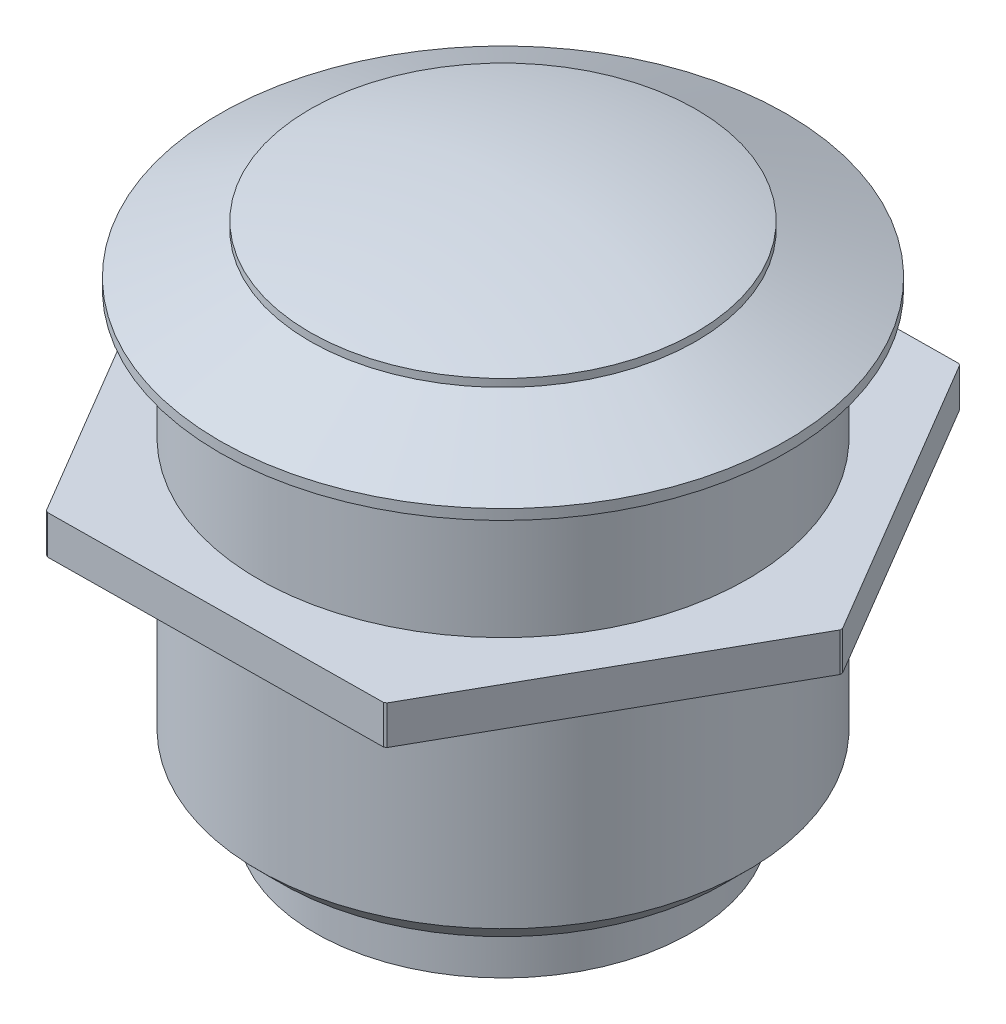
ISO-10303-21;
HEADER;
FILE_DESCRIPTION(('STEP AP214'),'2;1');
FILE_NAME('part.step','',(''),(''),'','','');
FILE_SCHEMA(('AUTOMOTIVE_DESIGN { 1 0 10303 214 1 1 1 1 }'));
ENDSEC;
DATA;
#1=APPLICATION_CONTEXT('core data for automotive mechanical design processes');
#2=APPLICATION_PROTOCOL_DEFINITION('international standard','automotive_design',2000,#1);
#3=PRODUCT_CONTEXT('',#1,'mechanical');
#4=PRODUCT('Part','Part','',(#3));
#5=PRODUCT_RELATED_PRODUCT_CATEGORY('part','',(#4));
#6=PRODUCT_DEFINITION_FORMATION('','',#4);
#7=PRODUCT_DEFINITION_CONTEXT('part definition',#1,'design');
#8=PRODUCT_DEFINITION('design','',#6,#7);
#9=PRODUCT_DEFINITION_SHAPE('','',#8);
#10=(LENGTH_UNIT() NAMED_UNIT(*) SI_UNIT(.MILLI.,.METRE.));
#11=(NAMED_UNIT(*) PLANE_ANGLE_UNIT() SI_UNIT($,.RADIAN.));
#12=(NAMED_UNIT(*) SI_UNIT($,.STERADIAN.) SOLID_ANGLE_UNIT());
#13=UNCERTAINTY_MEASURE_WITH_UNIT(LENGTH_MEASURE(1.E-05),#10,'distance_accuracy_value','');
#14=(GEOMETRIC_REPRESENTATION_CONTEXT(3) GLOBAL_UNCERTAINTY_ASSIGNED_CONTEXT((#13)) GLOBAL_UNIT_ASSIGNED_CONTEXT((#10,
#11,#12)) REPRESENTATION_CONTEXT('',''));
#15=CARTESIAN_POINT('',(0.,0.,0.));
#16=DIRECTION('',(0.,0.,1.));
#17=DIRECTION('',(1.,0.,0.));
#18=AXIS2_PLACEMENT_3D('',#15,#16,#17);
#19=CARTESIAN_POINT('',(0.,0.,0.));
#20=DIRECTION('',(0.,-1.,0.));
#21=DIRECTION('',(0.,0.,-1.));
#22=AXIS2_PLACEMENT_3D('',#19,#20,#21);
#23=CYLINDRICAL_SURFACE('',#22,13.);
#24=DIRECTION('',(0.,-1.,0.));
#25=VECTOR('',#24,1.);
#26=CARTESIAN_POINT('',(-6.4247726112704,0.,11.30142897573));
#27=LINE('',#26,#25);
#28=CARTESIAN_POINT('',(-6.4247726112704,-9.8,11.30142897573));
#29=VERTEX_POINT('',#28);
#30=CARTESIAN_POINT('',(-6.4247726112704,-8.3,11.30142897573));
#31=VERTEX_POINT('',#30);
#32=EDGE_CURVE('E188',#29,#31,#27,.F.);
#33=ORIENTED_EDGE('',*,*,#32,.F.);
#34=CARTESIAN_POINT('',(0.,-9.8,0.));
#35=DIRECTION('',(0.,-1.,0.));
#36=DIRECTION('',(0.,0.,-1.));
#37=AXIS2_PLACEMENT_3D('',#34,#35,#36);
#38=CIRCLE('',#37,13.);
#39=CARTESIAN_POINT('',(-6.33692245556159,-9.8,11.3509212750419));
#40=VERTEX_POINT('',#39);
#41=EDGE_CURVE('E239',#40,#29,#38,.T.);
#42=ORIENTED_EDGE('',*,*,#41,.F.);
#43=DIRECTION('',(0.,-1.,0.));
#44=VECTOR('',#43,1.);
#45=CARTESIAN_POINT('',(-6.3369224555616,0.,11.3509212750419));
#46=LINE('',#45,#44);
#47=CARTESIAN_POINT('',(-6.33692245556159,-8.3,11.3509212750419));
#48=VERTEX_POINT('',#47);
#49=EDGE_CURVE('E190',#48,#40,#46,.T.);
#50=ORIENTED_EDGE('',*,*,#49,.F.);
#51=CARTESIAN_POINT('',(0.,-8.3,0.));
#52=DIRECTION('',(0.,-1.,0.));
#53=DIRECTION('',(0.,0.,-1.));
#54=AXIS2_PLACEMENT_3D('',#51,#52,#53);
#55=CIRCLE('',#54,13.);
#56=EDGE_CURVE('E159',#48,#31,#55,.T.);
#57=ORIENTED_EDGE('',*,*,#56,.T.);
#58=EDGE_LOOP('',(#33,#42,#50,#57));
#59=FACE_BOUND('',#58,.T.);
#60=ADVANCED_FACE('F38',(#59),#23,.T.);
#61=DIRECTION('',(0.,-1.,0.));
#62=VECTOR('',#61,1.);
#63=CARTESIAN_POINT('',(6.5749382864122,0.,11.2147307827638));
#64=LINE('',#63,#62);
#65=CARTESIAN_POINT('',(6.57493828641219,-9.8,11.2147307827639));
#66=VERTEX_POINT('',#65);
#67=CARTESIAN_POINT('',(6.5749382864122,-8.3,11.2147307827638));
#68=VERTEX_POINT('',#67);
#69=EDGE_CURVE('E216',#66,#68,#64,.F.);
#70=ORIENTED_EDGE('',*,*,#69,.F.);
#71=CARTESIAN_POINT('',(6.66172495276288,-9.8,11.1633964658493));
#72=VERTEX_POINT('',#71);
#73=EDGE_CURVE('E241',#72,#66,#38,.T.);
#74=ORIENTED_EDGE('',*,*,#73,.F.);
#75=DIRECTION('',(0.,-1.,0.));
#76=VECTOR('',#75,1.);
#77=CARTESIAN_POINT('',(6.66172495276287,0.,11.1633964658493));
#78=LINE('',#77,#76);
#79=CARTESIAN_POINT('',(6.66172495276287,-8.3,11.1633964658493));
#80=VERTEX_POINT('',#79);
#81=EDGE_CURVE('E211',#80,#72,#78,.T.);
#82=ORIENTED_EDGE('',*,*,#81,.F.);
#83=EDGE_CURVE('E172',#80,#68,#55,.T.);
#84=ORIENTED_EDGE('',*,*,#83,.T.);
#85=EDGE_LOOP('',(#70,#74,#82,#84));
#86=FACE_BOUND('',#85,.T.);
#87=ADVANCED_FACE('F273',(#86),#23,.T.);
#88=DIRECTION('',(0.,-1.,0.));
#89=VECTOR('',#88,1.);
#90=CARTESIAN_POINT('',(12.9997108976829,0.,-0.0866981929659666));
#91=LINE('',#90,#89);
#92=CARTESIAN_POINT('',(12.9997108976829,-9.8,-0.0866981929659562));
#93=VERTEX_POINT('',#92);
#94=CARTESIAN_POINT('',(12.9997108976829,-8.3,-0.0866981929659666));
#95=VERTEX_POINT('',#94);
#96=EDGE_CURVE('E213',#93,#95,#91,.F.);
#97=ORIENTED_EDGE('',*,*,#96,.F.);
#98=CARTESIAN_POINT('',(12.9986474083243,-9.8,-0.187524809193015));
#99=VERTEX_POINT('',#98);
#100=EDGE_CURVE('E161',#99,#93,#38,.T.);
#101=ORIENTED_EDGE('',*,*,#100,.F.);
#102=DIRECTION('',(0.,-1.,0.));
#103=VECTOR('',#102,1.);
#104=CARTESIAN_POINT('',(12.9986474083243,0.,-0.187524809193004));
#105=LINE('',#104,#103);
#106=CARTESIAN_POINT('',(12.9986474083243,-8.3,-0.187524809193008));
#107=VERTEX_POINT('',#106);
#108=EDGE_CURVE('E207',#107,#99,#105,.T.);
#109=ORIENTED_EDGE('',*,*,#108,.F.);
#110=EDGE_CURVE('E166',#107,#95,#55,.T.);
#111=ORIENTED_EDGE('',*,*,#110,.T.);
#112=EDGE_LOOP('',(#97,#101,#109,#111));
#113=FACE_BOUND('',#112,.T.);
#114=ADVANCED_FACE('F253',(#113),#23,.T.);
#115=DIRECTION('',(0.,-1.,0.));
#116=VECTOR('',#115,1.);
#117=CARTESIAN_POINT('',(6.42477261127073,0.,-11.3014289757298));
#118=LINE('',#117,#116);
#119=CARTESIAN_POINT('',(6.42477261127074,-9.8,-11.3014289757298));
#120=VERTEX_POINT('',#119);
#121=CARTESIAN_POINT('',(6.42477261127074,-8.3,-11.3014289757298));
#122=VERTEX_POINT('',#121);
#123=EDGE_CURVE('E209',#120,#122,#118,.F.);
#124=ORIENTED_EDGE('',*,*,#123,.F.);
#125=CARTESIAN_POINT('',(6.33692245556148,-9.8,-11.350921275042));
#126=VERTEX_POINT('',#125);
#127=EDGE_CURVE('E156',#126,#120,#38,.T.);
#128=ORIENTED_EDGE('',*,*,#127,.F.);
#129=DIRECTION('',(0.,-1.,0.));
#130=VECTOR('',#129,1.);
#131=CARTESIAN_POINT('',(6.33692245556148,0.,-11.350921275042));
#132=LINE('',#131,#130);
#133=CARTESIAN_POINT('',(6.33692245556148,-8.3,-11.350921275042));
#134=VERTEX_POINT('',#133);
#135=EDGE_CURVE('E139',#134,#126,#132,.T.);
#136=ORIENTED_EDGE('',*,*,#135,.F.);
#137=EDGE_CURVE('E151',#134,#122,#55,.T.);
#138=ORIENTED_EDGE('',*,*,#137,.T.);
#139=EDGE_LOOP('',(#124,#128,#136,#138));
#140=FACE_BOUND('',#139,.T.);
#141=ADVANCED_FACE('F260',(#140),#23,.T.);
#142=DIRECTION('',(0.,-1.,0.));
#143=VECTOR('',#142,1.);
#144=CARTESIAN_POINT('',(-12.9986474083243,0.,0.187524809192772));
#145=LINE('',#144,#143);
#146=CARTESIAN_POINT('',(-12.9986474083243,-8.3,0.187524809192772));
#147=VERTEX_POINT('',#146);
#148=CARTESIAN_POINT('',(-12.9986474083243,-9.8,0.187524809192771));
#149=VERTEX_POINT('',#148);
#150=EDGE_CURVE('E60',#147,#149,#145,.T.);
#151=ORIENTED_EDGE('',*,*,#150,.F.);
#152=CARTESIAN_POINT('',(-12.9997108976829,-8.3,0.086698192965951));
#153=VERTEX_POINT('',#152);
#154=EDGE_CURVE('E155',#147,#153,#55,.T.);
#155=ORIENTED_EDGE('',*,*,#154,.T.);
#156=DIRECTION('',(0.,-1.,0.));
#157=VECTOR('',#156,1.);
#158=CARTESIAN_POINT('',(-12.9997108976829,0.,0.086698192965951));
#159=LINE('',#158,#157);
#160=CARTESIAN_POINT('',(-12.9997108976829,-9.8,0.0866981929659519));
#161=VERTEX_POINT('',#160);
#162=EDGE_CURVE('E205',#161,#153,#159,.F.);
#163=ORIENTED_EDGE('',*,*,#162,.F.);
#164=EDGE_CURVE('E236',#149,#161,#38,.T.);
#165=ORIENTED_EDGE('',*,*,#164,.F.);
#166=EDGE_LOOP('',(#151,#155,#163,#165));
#167=FACE_BOUND('',#166,.T.);
#168=ADVANCED_FACE('F283',(#167),#23,.T.);
#169=CARTESIAN_POINT('',(0.,-29.9994402655802,0.183258702077359));
#170=DIRECTION('',(-1.,0.,0.));
#171=DIRECTION('',(0.,0.,-1.));
#172=AXIS2_PLACEMENT_3D('',#169,#170,#171);
#173=CIRCLE('',#172,30.);
#174=TRIMMED_CURVE('',#173,(PARAMETER_VALUE(-1.56468766540085)),
(PARAMETER_VALUE(1.56468766540085)),.T.,.PARAMETER.);
#175=CARTESIAN_POINT('',(0.,-29.9994402655802,0.));
#176=DIRECTION('',(0.,-1.,0.));
#177=AXIS1_PLACEMENT('',#175,#176);
#178=SURFACE_OF_REVOLUTION('',#174,#177);
#179=CARTESIAN_POINT('',(0.,0.,0.));
#180=VERTEX_POINT('',#179);
#181=VERTEX_LOOP('',#180);
#182=FACE_BOUND('',#181,.T.);
#183=CARTESIAN_POINT('',(0.,-1.,0.));
#184=DIRECTION('',(0.,-1.,0.));
#185=DIRECTION('',(0.,0.,-1.));
#186=AXIS2_PLACEMENT_3D('',#183,#184,#185);
#187=CIRCLE('',#186,7.5);
#188=CARTESIAN_POINT('',(0.,-1.,-7.5));
#189=VERTEX_POINT('',#188);
#190=EDGE_CURVE('E262',#189,#189,#187,.T.);
#191=ORIENTED_EDGE('',*,*,#190,.F.);
#192=EDGE_LOOP('',(#191));
#193=FACE_BOUND('',#192,.T.);
#194=ADVANCED_FACE('F40',(#182,#193),#178,.T.);
#195=CARTESIAN_POINT('',(0.,0.,0.));
#196=DIRECTION('',(0.,-1.,0.));
#197=DIRECTION('',(0.,0.,-1.));
#198=AXIS2_PLACEMENT_3D('',#195,#196,#197);
#199=CYLINDRICAL_SURFACE('',#198,7.5);
#200=ORIENTED_EDGE('',*,*,#190,.T.);
#201=EDGE_LOOP('',(#200));
#202=FACE_BOUND('',#201,.T.);
#203=CARTESIAN_POINT('',(0.,-1.3,0.));
#204=DIRECTION('',(0.,-1.,0.));
#205=DIRECTION('',(0.,0.,-1.));
#206=AXIS2_PLACEMENT_3D('',#203,#204,#205);
#207=CIRCLE('',#206,7.5);
#208=CARTESIAN_POINT('',(0.,-1.3,-7.5));
#209=VERTEX_POINT('',#208);
#210=EDGE_CURVE('E266',#209,#209,#207,.T.);
#211=ORIENTED_EDGE('',*,*,#210,.F.);
#212=EDGE_LOOP('',(#211));
#213=FACE_BOUND('',#212,.T.);
#214=ADVANCED_FACE('F301',(#202,#213),#199,.T.);
#215=CARTESIAN_POINT('',(0.,-2.9,0.));
#216=DIRECTION('',(0.,-1.,0.));
#217=DIRECTION('',(0.,0.,-1.));
#218=AXIS2_PLACEMENT_3D('',#215,#216,#217);
#219=CONICAL_SURFACE('',#218,11.,1.14201829934888);
#220=ORIENTED_EDGE('',*,*,#210,.T.);
#221=EDGE_LOOP('',(#220));
#222=FACE_BOUND('',#221,.T.);
#223=CARTESIAN_POINT('',(0.,-2.9,0.));
#224=DIRECTION('',(0.,-1.,0.));
#225=DIRECTION('',(0.,0.,-1.));
#226=AXIS2_PLACEMENT_3D('',#223,#224,#225);
#227=CIRCLE('',#226,11.);
#228=CARTESIAN_POINT('',(0.,-2.9,-11.));
#229=VERTEX_POINT('',#228);
#230=EDGE_CURVE('E313',#229,#229,#227,.T.);
#231=ORIENTED_EDGE('',*,*,#230,.F.);
#232=EDGE_LOOP('',(#231));
#233=FACE_BOUND('',#232,.T.);
#234=ADVANCED_FACE('F298',(#222,#233),#219,.T.);
#235=CARTESIAN_POINT('',(0.,0.,0.));
#236=DIRECTION('',(0.,-1.,0.));
#237=DIRECTION('',(0.,0.,-1.));
#238=AXIS2_PLACEMENT_3D('',#235,#236,#237);
#239=CYLINDRICAL_SURFACE('',#238,11.);
#240=ORIENTED_EDGE('',*,*,#230,.T.);
#241=EDGE_LOOP('',(#240));
#242=FACE_BOUND('',#241,.T.);
#243=CARTESIAN_POINT('',(0.,-3.3,0.));
#244=DIRECTION('',(0.,-1.,0.));
#245=DIRECTION('',(0.,0.,-1.));
#246=AXIS2_PLACEMENT_3D('',#243,#244,#245);
#247=CIRCLE('',#246,11.);
#248=CARTESIAN_POINT('',(0.,-3.3,-11.));
#249=VERTEX_POINT('',#248);
#250=EDGE_CURVE('E315',#249,#249,#247,.T.);
#251=ORIENTED_EDGE('',*,*,#250,.F.);
#252=EDGE_LOOP('',(#251));
#253=FACE_BOUND('',#252,.T.);
#254=ADVANCED_FACE('F294',(#242,#253),#239,.T.);
#255=CARTESIAN_POINT('',(11.,-3.3,0.));
#256=DIRECTION('',(0.,-1.,0.));
#257=DIRECTION('',(0.,0.,-1.));
#258=AXIS2_PLACEMENT_3D('',#255,#256,#257);
#259=PLANE('',#258);
#260=ORIENTED_EDGE('',*,*,#250,.T.);
#261=EDGE_LOOP('',(#260));
#262=FACE_BOUND('',#261,.T.);
#263=CARTESIAN_POINT('',(0.,-3.3,0.));
#264=DIRECTION('',(0.,-1.,0.));
#265=DIRECTION('',(0.,0.,-1.));
#266=AXIS2_PLACEMENT_3D('',#263,#264,#265);
#267=CIRCLE('',#266,9.5);
#268=CARTESIAN_POINT('',(0.,-3.3,-9.5));
#269=VERTEX_POINT('',#268);
#270=EDGE_CURVE('E170',#269,#269,#267,.T.);
#271=ORIENTED_EDGE('',*,*,#270,.F.);
#272=EDGE_LOOP('',(#271));
#273=FACE_BOUND('',#272,.T.);
#274=ADVANCED_FACE('F290',(#262,#273),#259,.T.);
#275=CARTESIAN_POINT('',(0.,0.,0.));
#276=DIRECTION('',(0.,-1.,0.));
#277=DIRECTION('',(0.,0.,-1.));
#278=AXIS2_PLACEMENT_3D('',#275,#276,#277);
#279=CYLINDRICAL_SURFACE('',#278,9.5);
#280=ORIENTED_EDGE('',*,*,#270,.T.);
#281=EDGE_LOOP('',(#280));
#282=FACE_BOUND('',#281,.T.);
#283=CARTESIAN_POINT('',(0.,-8.3,0.));
#284=DIRECTION('',(0.,-1.,0.));
#285=DIRECTION('',(0.,0.,-1.));
#286=AXIS2_PLACEMENT_3D('',#283,#284,#285);
#287=CIRCLE('',#286,9.5);
#288=CARTESIAN_POINT('',(0.,-8.3,-9.5));
#289=VERTEX_POINT('',#288);
#290=EDGE_CURVE('E165',#289,#289,#287,.T.);
#291=ORIENTED_EDGE('',*,*,#290,.F.);
#292=EDGE_LOOP('',(#291));
#293=FACE_BOUND('',#292,.T.);
#294=ADVANCED_FACE('F287',(#282,#293),#279,.T.);
#295=CARTESIAN_POINT('',(9.5,-8.3,0.));
#296=DIRECTION('',(0.,1.,0.));
#297=DIRECTION('',(0.,0.,1.));
#298=AXIS2_PLACEMENT_3D('',#295,#296,#297);
#299=PLANE('',#298);
#300=DIRECTION('',(-0.50910626080619,0.,-0.860703674447797));
#301=VECTOR('',#300,1.);
#302=CARTESIAN_POINT('',(-6.40233523920819,-8.3,11.3393619772773));
#303=LINE('',#302,#301);
#304=EDGE_CURVE('E194',#31,#147,#303,.T.);
#305=ORIENTED_EDGE('',*,*,#304,.F.);
#306=ORIENTED_EDGE('',*,*,#56,.F.);
#307=DIRECTION('',(-0.999944377605499,0.,0.010547117859944));
#308=VECTOR('',#307,1.);
#309=CARTESIAN_POINT('',(6.6190079154255,-8.3,11.2142659493375));
#310=LINE('',#309,#308);
#311=EDGE_CURVE('E192',#68,#48,#310,.T.);
#312=ORIENTED_EDGE('',*,*,#311,.F.);
#313=ORIENTED_EDGE('',*,*,#83,.F.);
#314=DIRECTION('',(-0.490838116799325,0.,0.871250792307756));
#315=VECTOR('',#314,1.);
#316=CARTESIAN_POINT('',(13.0213431546338,-8.3,-0.125096027940039));
#317=LINE('',#316,#315);
#318=EDGE_CURVE('E197',#95,#80,#317,.T.);
#319=ORIENTED_EDGE('',*,*,#318,.F.);
#320=ORIENTED_EDGE('',*,*,#110,.F.);
#321=DIRECTION('',(0.509106260806184,0.,0.8607036744478));
#322=VECTOR('',#321,1.);
#323=CARTESIAN_POINT('',(6.4023352392083,-8.3,-11.3393619772775));
#324=LINE('',#323,#322);
#325=EDGE_CURVE('E152',#122,#107,#324,.T.);
#326=ORIENTED_EDGE('',*,*,#325,.F.);
#327=ORIENTED_EDGE('',*,*,#137,.F.);
#328=DIRECTION('',(0.999944377605499,0.,-0.0105471178599573));
#329=VECTOR('',#328,1.);
#330=CARTESIAN_POINT('',(-6.61900791542543,-8.3,-11.2142659493373));
#331=LINE('',#330,#329);
#332=CARTESIAN_POINT('',(-6.57493828641239,-8.3,-11.2147307827637));
#333=VERTEX_POINT('',#332);
#334=EDGE_CURVE('E131',#333,#134,#331,.T.);
#335=ORIENTED_EDGE('',*,*,#334,.F.);
#336=CARTESIAN_POINT('',(-6.6617249527633,-8.3,-11.163396465849));
#337=VERTEX_POINT('',#336);
#338=EDGE_CURVE('E148',#337,#333,#55,.T.);
#339=ORIENTED_EDGE('',*,*,#338,.F.);
#340=DIRECTION('',(0.490838116799309,0.,-0.871250792307765));
#341=VECTOR('',#340,1.);
#342=CARTESIAN_POINT('',(-13.0213431546338,-8.3,0.125096027939942));
#343=LINE('',#342,#341);
#344=EDGE_CURVE('E195',#153,#337,#343,.T.);
#345=ORIENTED_EDGE('',*,*,#344,.F.);
#346=ORIENTED_EDGE('',*,*,#154,.F.);
#347=EDGE_LOOP('',(#305,#306,#312,#313,#319,#320,#326,#327,#335,#339,#345,#346));
#348=FACE_BOUND('',#347,.T.);
#349=ORIENTED_EDGE('',*,*,#290,.T.);
#350=EDGE_LOOP('',(#349));
#351=FACE_BOUND('',#350,.T.);
#352=ADVANCED_FACE('F145',(#348,#351),#299,.T.);
#353=DIRECTION('',(0.,-1.,0.));
#354=VECTOR('',#353,1.);
#355=CARTESIAN_POINT('',(-6.6617249527633,0.,-11.163396465849));
#356=LINE('',#355,#354);
#357=CARTESIAN_POINT('',(-6.6617249527633,-9.8,-11.163396465849));
#358=VERTEX_POINT('',#357);
#359=EDGE_CURVE('E53',#337,#358,#356,.T.);
#360=ORIENTED_EDGE('',*,*,#359,.F.);
#361=ORIENTED_EDGE('',*,*,#338,.T.);
#362=DIRECTION('',(0.,-1.,0.));
#363=VECTOR('',#362,1.);
#364=CARTESIAN_POINT('',(-6.57493828641239,0.,-11.2147307827637));
#365=LINE('',#364,#363);
#366=CARTESIAN_POINT('',(-6.57493828641239,-9.8,-11.2147307827637));
#367=VERTEX_POINT('',#366);
#368=EDGE_CURVE('E128',#367,#333,#365,.F.);
#369=ORIENTED_EDGE('',*,*,#368,.F.);
#370=EDGE_CURVE('E163',#358,#367,#38,.T.);
#371=ORIENTED_EDGE('',*,*,#370,.F.);
#372=EDGE_LOOP('',(#360,#361,#369,#371));
#373=FACE_BOUND('',#372,.T.);
#374=ADVANCED_FACE('F154',(#373),#23,.T.);
#375=CARTESIAN_POINT('',(13.,-9.8,0.));
#376=DIRECTION('',(0.,-1.,0.));
#377=DIRECTION('',(0.,0.,-1.));
#378=AXIS2_PLACEMENT_3D('',#375,#376,#377);
#379=PLANE('',#378);
#380=DIRECTION('',(0.50910626080619,0.,0.860703674447797));
#381=VECTOR('',#380,1.);
#382=CARTESIAN_POINT('',(-6.34225060750059,-9.8,11.4409420741448));
#383=LINE('',#382,#381);
#384=EDGE_CURVE('E11',#149,#29,#383,.T.);
#385=ORIENTED_EDGE('',*,*,#384,.F.);
#386=ORIENTED_EDGE('',*,*,#164,.T.);
#387=DIRECTION('',(-0.490838116799309,0.,0.871250792307765));
#388=VECTOR('',#387,1.);
#389=CARTESIAN_POINT('',(-6.69873118548292,-9.8,-11.0977094124728));
#390=LINE('',#389,#388);
#391=EDGE_CURVE('E261',#358,#161,#390,.T.);
#392=ORIENTED_EDGE('',*,*,#391,.F.);
#393=ORIENTED_EDGE('',*,*,#370,.T.);
#394=DIRECTION('',(-0.999944377605499,0.,0.0105471178599573));
#395=VECTOR('',#394,1.);
#396=CARTESIAN_POINT('',(12.8795459425376,-9.8,-11.4199309345549));
#397=LINE('',#396,#395);
#398=EDGE_CURVE('E134',#126,#367,#397,.T.);
#399=ORIENTED_EDGE('',*,*,#398,.F.);
#400=ORIENTED_EDGE('',*,*,#127,.T.);
#401=DIRECTION('',(-0.509106260806185,0.,-0.860703674447801));
#402=VECTOR('',#401,1.);
#403=CARTESIAN_POINT('',(13.0811694120943,-9.8,-0.0480117107779893));
#404=LINE('',#403,#402);
#405=EDGE_CURVE('E252',#99,#120,#404,.T.);
#406=ORIENTED_EDGE('',*,*,#405,.F.);
#407=ORIENTED_EDGE('',*,*,#100,.T.);
#408=DIRECTION('',(0.490838116799325,0.,-0.871250792307756));
#409=VECTOR('',#408,1.);
#410=CARTESIAN_POINT('',(12.9627046649633,-9.8,-0.0210111395896963));
#411=LINE('',#410,#409);
#412=EDGE_CURVE('E251',#72,#93,#411,.T.);
#413=ORIENTED_EDGE('',*,*,#412,.F.);
#414=ORIENTED_EDGE('',*,*,#73,.T.);
#415=DIRECTION('',(0.999944377605499,0.,-0.010547117859944));
#416=VECTOR('',#415,1.);
#417=CARTESIAN_POINT('',(13.1175617733883,-9.8,11.145721123251));
#418=LINE('',#417,#416);
#419=EDGE_CURVE('E46',#40,#66,#418,.T.);
#420=ORIENTED_EDGE('',*,*,#419,.F.);
#421=ORIENTED_EDGE('',*,*,#41,.T.);
#422=EDGE_LOOP('',(#385,#386,#392,#393,#399,#400,#406,#407,#413,#414,#420,#421));
#423=FACE_BOUND('',#422,.T.);
#424=CARTESIAN_POINT('',(0.,-9.8,0.));
#425=DIRECTION('',(0.,-1.,0.));
#426=DIRECTION('',(0.,0.,-1.));
#427=AXIS2_PLACEMENT_3D('',#424,#425,#426);
#428=CIRCLE('',#427,9.5);
#429=CARTESIAN_POINT('',(0.,-9.8,-9.5));
#430=VERTEX_POINT('',#429);
#431=EDGE_CURVE('E232',#430,#430,#428,.T.);
#432=ORIENTED_EDGE('',*,*,#431,.F.);
#433=EDGE_LOOP('',(#432));
#434=FACE_BOUND('',#433,.T.);
#435=ADVANCED_FACE('F249',(#423,#434),#379,.T.);
#436=CARTESIAN_POINT('',(0.,0.,0.));
#437=DIRECTION('',(0.,-1.,0.));
#438=DIRECTION('',(0.,0.,-1.));
#439=AXIS2_PLACEMENT_3D('',#436,#437,#438);
#440=CYLINDRICAL_SURFACE('',#439,9.5);
#441=ORIENTED_EDGE('',*,*,#431,.T.);
#442=EDGE_LOOP('',(#441));
#443=FACE_BOUND('',#442,.T.);
#444=CARTESIAN_POINT('',(0.,-18.0887301627792,0.));
#445=DIRECTION('',(0.,-1.,0.));
#446=DIRECTION('',(0.,0.,-1.));
#447=AXIS2_PLACEMENT_3D('',#444,#445,#446);
#448=CIRCLE('',#447,9.5);
#449=CARTESIAN_POINT('',(0.,-18.0887301627792,-9.5));
#450=VERTEX_POINT('',#449);
#451=EDGE_CURVE('E229',#450,#450,#448,.T.);
#452=ORIENTED_EDGE('',*,*,#451,.F.);
#453=EDGE_LOOP('',(#452));
#454=FACE_BOUND('',#453,.T.);
#455=ADVANCED_FACE('F369',(#443,#454),#440,.T.);
#456=CARTESIAN_POINT('',(0.,-19.,0.));
#457=DIRECTION('',(0.,1.,0.));
#458=DIRECTION('',(0.,0.,1.));
#459=AXIS2_PLACEMENT_3D('',#456,#457,#458);
#460=CONICAL_SURFACE('',#459,8.58873016277919,0.785398163397448);
#461=ORIENTED_EDGE('',*,*,#451,.T.);
#462=EDGE_LOOP('',(#461));
#463=FACE_BOUND('',#462,.T.);
#464=CARTESIAN_POINT('',(0.,-19.,0.));
#465=DIRECTION('',(0.,-1.,0.));
#466=DIRECTION('',(0.,0.,-1.));
#467=AXIS2_PLACEMENT_3D('',#464,#465,#466);
#468=CIRCLE('',#467,8.58873016277919);
#469=CARTESIAN_POINT('',(0.,-19.,-8.58873016277919));
#470=VERTEX_POINT('',#469);
#471=EDGE_CURVE('E226',#470,#470,#468,.T.);
#472=ORIENTED_EDGE('',*,*,#471,.F.);
#473=EDGE_LOOP('',(#472));
#474=FACE_BOUND('',#473,.T.);
#475=ADVANCED_FACE('F366',(#463,#474),#460,.T.);
#476=CARTESIAN_POINT('',(8.58873016277919,-19.,0.));
#477=DIRECTION('',(0.,-1.,0.));
#478=DIRECTION('',(0.,0.,-1.));
#479=AXIS2_PLACEMENT_3D('',#476,#477,#478);
#480=PLANE('',#479);
#481=ORIENTED_EDGE('',*,*,#471,.T.);
#482=EDGE_LOOP('',(#481));
#483=FACE_BOUND('',#482,.T.);
#484=CARTESIAN_POINT('',(0.,-19.,0.));
#485=DIRECTION('',(0.,-1.,0.));
#486=DIRECTION('',(0.,0.,-1.));
#487=AXIS2_PLACEMENT_3D('',#484,#485,#486);
#488=CIRCLE('',#487,7.3);
#489=CARTESIAN_POINT('',(0.,-19.,-7.3));
#490=VERTEX_POINT('',#489);
#491=EDGE_CURVE('E223',#490,#490,#488,.T.);
#492=ORIENTED_EDGE('',*,*,#491,.F.);
#493=EDGE_LOOP('',(#492));
#494=FACE_BOUND('',#493,.T.);
#495=ADVANCED_FACE('F362',(#483,#494),#480,.T.);
#496=CARTESIAN_POINT('',(0.,0.,0.));
#497=DIRECTION('',(0.,-1.,0.));
#498=DIRECTION('',(0.,0.,-1.));
#499=AXIS2_PLACEMENT_3D('',#496,#497,#498);
#500=CYLINDRICAL_SURFACE('',#499,7.3);
#501=ORIENTED_EDGE('',*,*,#491,.T.);
#502=EDGE_LOOP('',(#501));
#503=FACE_BOUND('',#502,.T.);
#504=CARTESIAN_POINT('',(0.,-21.3,0.));
#505=DIRECTION('',(0.,-1.,0.));
#506=DIRECTION('',(0.,0.,-1.));
#507=AXIS2_PLACEMENT_3D('',#504,#505,#506);
#508=CIRCLE('',#507,7.3);
#509=CARTESIAN_POINT('',(0.,-21.3,-7.3));
#510=VERTEX_POINT('',#509);
#511=EDGE_CURVE('E220',#510,#510,#508,.T.);
#512=ORIENTED_EDGE('',*,*,#511,.F.);
#513=EDGE_LOOP('',(#512));
#514=FACE_BOUND('',#513,.T.);
#515=ADVANCED_FACE('F358',(#503,#514),#500,.T.);
#516=CARTESIAN_POINT('',(7.3,-21.3,0.));
#517=DIRECTION('',(0.,-1.,0.));
#518=DIRECTION('',(0.,0.,-1.));
#519=AXIS2_PLACEMENT_3D('',#516,#517,#518);
#520=PLANE('',#519);
#521=ORIENTED_EDGE('',*,*,#511,.T.);
#522=EDGE_LOOP('',(#521));
#523=FACE_BOUND('',#522,.T.);
#524=ADVANCED_FACE('F346',(#523),#520,.T.);
#525=CARTESIAN_POINT('',(-6.61900791542543,-21.3,-11.2142659493373));
#526=DIRECTION('',(0.0105471178599573,0.,0.999944377605499));
#527=DIRECTION('',(0.999944377605499,0.,-0.0105471178599573));
#528=AXIS2_PLACEMENT_3D('',#525,#526,#527);
#529=PLANE('',#528);
#530=ORIENTED_EDGE('',*,*,#368,.T.);
#531=ORIENTED_EDGE('',*,*,#334,.T.);
#532=ORIENTED_EDGE('',*,*,#135,.T.);
#533=ORIENTED_EDGE('',*,*,#398,.T.);
#534=EDGE_LOOP('',(#530,#531,#532,#533));
#535=FACE_BOUND('',#534,.T.);
#536=ADVANCED_FACE('F130',(#535),#529,.F.);
#537=CARTESIAN_POINT('',(-13.0213431546338,-21.3,0.125096027939942));
#538=DIRECTION('',(0.871250792307765,0.,0.490838116799309));
#539=DIRECTION('',(0.490838116799309,0.,-0.871250792307765));
#540=AXIS2_PLACEMENT_3D('',#537,#538,#539);
#541=PLANE('',#540);
#542=ORIENTED_EDGE('',*,*,#162,.T.);
#543=ORIENTED_EDGE('',*,*,#344,.T.);
#544=ORIENTED_EDGE('',*,*,#359,.T.);
#545=ORIENTED_EDGE('',*,*,#391,.T.);
#546=EDGE_LOOP('',(#542,#543,#544,#545));
#547=FACE_BOUND('',#546,.T.);
#548=ADVANCED_FACE('F338',(#547),#541,.F.);
#549=CARTESIAN_POINT('',(6.4023352392083,-21.3,-11.3393619772775));
#550=DIRECTION('',(-0.8607036744478,0.,0.509106260806184));
#551=DIRECTION('',(0.509106260806185,0.,0.860703674447801));
#552=AXIS2_PLACEMENT_3D('',#549,#550,#551);
#553=PLANE('',#552);
#554=ORIENTED_EDGE('',*,*,#123,.T.);
#555=ORIENTED_EDGE('',*,*,#325,.T.);
#556=ORIENTED_EDGE('',*,*,#108,.T.);
#557=ORIENTED_EDGE('',*,*,#405,.T.);
#558=EDGE_LOOP('',(#554,#555,#556,#557));
#559=FACE_BOUND('',#558,.T.);
#560=ADVANCED_FACE('F258',(#559),#553,.F.);
#561=CARTESIAN_POINT('',(13.0213431546338,-21.3,-0.125096027940039));
#562=DIRECTION('',(-0.871250792307756,0.,-0.490838116799325));
#563=DIRECTION('',(-0.490838116799325,0.,0.871250792307756));
#564=AXIS2_PLACEMENT_3D('',#561,#562,#563);
#565=PLANE('',#564);
#566=ORIENTED_EDGE('',*,*,#96,.T.);
#567=ORIENTED_EDGE('',*,*,#318,.T.);
#568=ORIENTED_EDGE('',*,*,#81,.T.);
#569=ORIENTED_EDGE('',*,*,#412,.T.);
#570=EDGE_LOOP('',(#566,#567,#568,#569));
#571=FACE_BOUND('',#570,.T.);
#572=ADVANCED_FACE('F256',(#571),#565,.F.);
#573=CARTESIAN_POINT('',(6.6190079154255,-21.3,11.2142659493375));
#574=DIRECTION('',(-0.010547117859944,0.,-0.999944377605499));
#575=DIRECTION('',(-0.999944377605499,0.,0.010547117859944));
#576=AXIS2_PLACEMENT_3D('',#573,#574,#575);
#577=PLANE('',#576);
#578=ORIENTED_EDGE('',*,*,#69,.T.);
#579=ORIENTED_EDGE('',*,*,#311,.T.);
#580=ORIENTED_EDGE('',*,*,#49,.T.);
#581=ORIENTED_EDGE('',*,*,#419,.T.);
#582=EDGE_LOOP('',(#578,#579,#580,#581));
#583=FACE_BOUND('',#582,.T.);
#584=ADVANCED_FACE('F272',(#583),#577,.F.);
#585=CARTESIAN_POINT('',(-6.40233523920819,-21.3,11.3393619772773));
#586=DIRECTION('',(0.860703674447797,0.,-0.50910626080619));
#587=DIRECTION('',(-0.50910626080619,0.,-0.860703674447797));
#588=AXIS2_PLACEMENT_3D('',#585,#586,#587);
#589=PLANE('',#588);
#590=ORIENTED_EDGE('',*,*,#32,.T.);
#591=ORIENTED_EDGE('',*,*,#304,.T.);
#592=ORIENTED_EDGE('',*,*,#150,.T.);
#593=ORIENTED_EDGE('',*,*,#384,.T.);
#594=EDGE_LOOP('',(#590,#591,#592,#593));
#595=FACE_BOUND('',#594,.T.);
#596=ADVANCED_FACE('F351',(#595),#589,.F.);
#597=CLOSED_SHELL('',(#60,#87,#114,#141,#168,#194,#214,#234,#254,#274,#294,#352,#374,#435,#455,
#475,#495,#515,#524,#536,#548,#560,#572,#584,#596));
#598=MANIFOLD_SOLID_BREP('B2',#597);
#599=ADVANCED_BREP_SHAPE_REPRESENTATION('',(#18,#598),#14);
#600=SHAPE_DEFINITION_REPRESENTATION(#9,#599);
ENDSEC;
END-ISO-10303-21;
